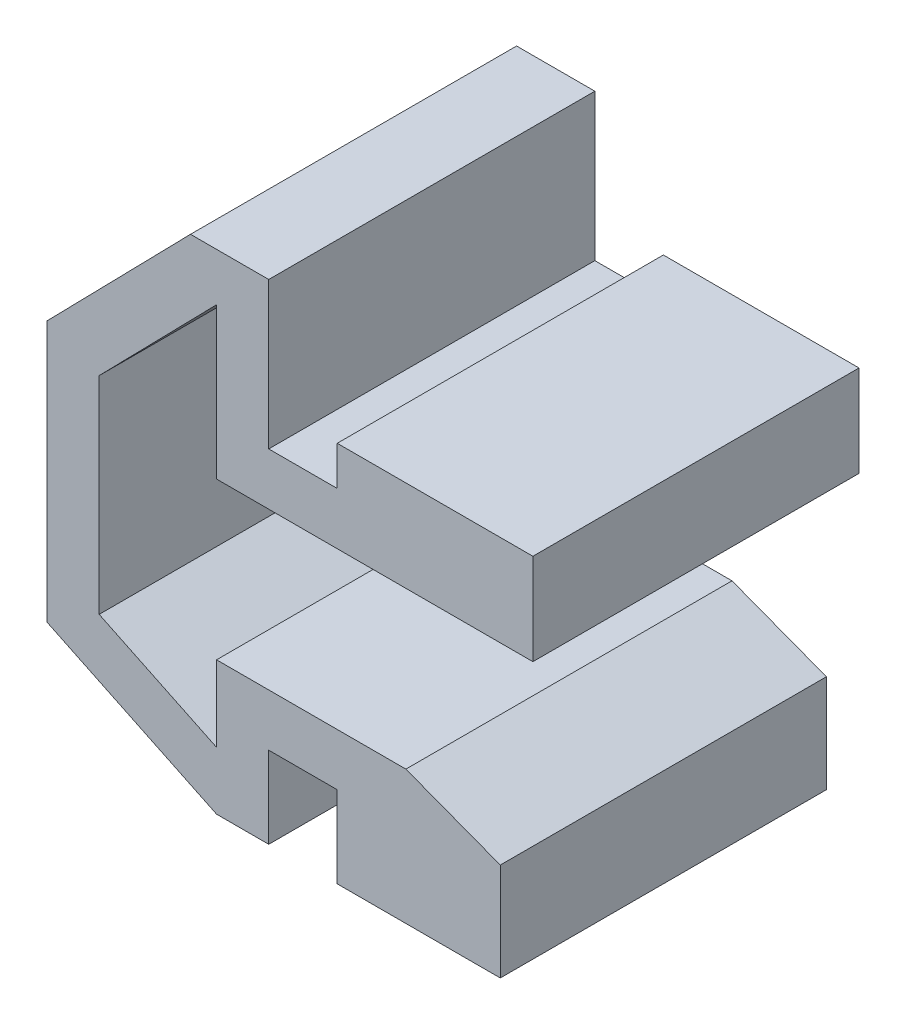
ISO-10303-21;
HEADER;
FILE_DESCRIPTION(('STEP AP214'),'2;1');
FILE_NAME('part.step','',(''),(''),'','','');
FILE_SCHEMA(('AUTOMOTIVE_DESIGN { 1 0 10303 214 1 1 1 1 }'));
ENDSEC;
DATA;
#1=APPLICATION_CONTEXT('core data for automotive mechanical design processes');
#2=APPLICATION_PROTOCOL_DEFINITION('international standard','automotive_design',2000,#1);
#3=PRODUCT_CONTEXT('',#1,'mechanical');
#4=PRODUCT('Part','Part','',(#3));
#5=PRODUCT_RELATED_PRODUCT_CATEGORY('part','',(#4));
#6=PRODUCT_DEFINITION_FORMATION('','',#4);
#7=PRODUCT_DEFINITION_CONTEXT('part definition',#1,'design');
#8=PRODUCT_DEFINITION('design','',#6,#7);
#9=PRODUCT_DEFINITION_SHAPE('','',#8);
#10=(LENGTH_UNIT() NAMED_UNIT(*) SI_UNIT(.MILLI.,.METRE.));
#11=(NAMED_UNIT(*) PLANE_ANGLE_UNIT() SI_UNIT($,.RADIAN.));
#12=(NAMED_UNIT(*) SI_UNIT($,.STERADIAN.) SOLID_ANGLE_UNIT());
#13=UNCERTAINTY_MEASURE_WITH_UNIT(LENGTH_MEASURE(1.E-05),#10,'distance_accuracy_value','');
#14=(GEOMETRIC_REPRESENTATION_CONTEXT(3) GLOBAL_UNCERTAINTY_ASSIGNED_CONTEXT((#13)) GLOBAL_UNIT_ASSIGNED_CONTEXT((#10,
#11,#12)) REPRESENTATION_CONTEXT('',''));
#15=CARTESIAN_POINT('',(0.,0.,0.));
#16=DIRECTION('',(0.,0.,1.));
#17=DIRECTION('',(1.,0.,0.));
#18=AXIS2_PLACEMENT_3D('',#15,#16,#17);
#19=CARTESIAN_POINT('',(0.,4.,5.));
#20=DIRECTION('',(0.,-1.,0.));
#21=DIRECTION('',(1.,0.,0.));
#22=AXIS2_PLACEMENT_3D('',#19,#20,#21);
#23=PLANE('',#22);
#24=DIRECTION('',(-1.,0.,0.));
#25=VECTOR('',#24,1.);
#26=CARTESIAN_POINT('',(0.,4.,-5.));
#27=LINE('',#26,#25);
#28=CARTESIAN_POINT('',(0.,4.,-5.));
#29=VERTEX_POINT('',#28);
#30=CARTESIAN_POINT('',(-2.1,4.,-5.));
#31=VERTEX_POINT('',#30);
#32=EDGE_CURVE('E139',#29,#31,#27,.T.);
#33=ORIENTED_EDGE('',*,*,#32,.T.);
#34=DIRECTION('',(0.,0.,-1.));
#35=VECTOR('',#34,1.);
#36=CARTESIAN_POINT('',(-2.1,4.,5.));
#37=LINE('',#36,#35);
#38=CARTESIAN_POINT('',(-2.1,4.,5.));
#39=VERTEX_POINT('',#38);
#40=EDGE_CURVE('E162',#39,#31,#37,.T.);
#41=ORIENTED_EDGE('',*,*,#40,.F.);
#42=DIRECTION('',(-1.,0.,0.));
#43=VECTOR('',#42,1.);
#44=CARTESIAN_POINT('',(0.,4.,5.));
#45=LINE('',#44,#43);
#46=CARTESIAN_POINT('',(0.,4.,5.));
#47=VERTEX_POINT('',#46);
#48=EDGE_CURVE('E93',#47,#39,#45,.T.);
#49=ORIENTED_EDGE('',*,*,#48,.F.);
#50=DIRECTION('',(0.,0.,-1.));
#51=VECTOR('',#50,1.);
#52=CARTESIAN_POINT('',(0.,4.,5.));
#53=LINE('',#52,#51);
#54=EDGE_CURVE('E40',#47,#29,#53,.T.);
#55=ORIENTED_EDGE('',*,*,#54,.T.);
#56=EDGE_LOOP('',(#33,#41,#49,#55));
#57=FACE_BOUND('',#56,.T.);
#58=ADVANCED_FACE('F33',(#57),#23,.F.);
#59=CARTESIAN_POINT('',(-2.1,4.,5.));
#60=DIRECTION('',(-1.,0.,0.));
#61=DIRECTION('',(0.,-1.,0.));
#62=AXIS2_PLACEMENT_3D('',#59,#60,#61);
#63=PLANE('',#62);
#64=DIRECTION('',(0.,1.,0.));
#65=VECTOR('',#64,1.);
#66=CARTESIAN_POINT('',(-2.1,4.,-5.));
#67=LINE('',#66,#65);
#68=CARTESIAN_POINT('',(-2.1,8.5,-5.));
#69=VERTEX_POINT('',#68);
#70=EDGE_CURVE('E141',#31,#69,#67,.T.);
#71=ORIENTED_EDGE('',*,*,#70,.T.);
#72=DIRECTION('',(0.,0.,-1.));
#73=VECTOR('',#72,1.);
#74=CARTESIAN_POINT('',(-2.1,8.5,5.));
#75=LINE('',#74,#73);
#76=CARTESIAN_POINT('',(-2.1,8.5,5.));
#77=VERTEX_POINT('',#76);
#78=EDGE_CURVE('E124',#77,#69,#75,.T.);
#79=ORIENTED_EDGE('',*,*,#78,.F.);
#80=DIRECTION('',(0.,1.,0.));
#81=VECTOR('',#80,1.);
#82=CARTESIAN_POINT('',(-2.1,4.,5.));
#83=LINE('',#82,#81);
#84=EDGE_CURVE('E112',#39,#77,#83,.T.);
#85=ORIENTED_EDGE('',*,*,#84,.F.);
#86=ORIENTED_EDGE('',*,*,#40,.T.);
#87=EDGE_LOOP('',(#71,#79,#85,#86));
#88=FACE_BOUND('',#87,.T.);
#89=ADVANCED_FACE('F239',(#88),#63,.F.);
#90=CARTESIAN_POINT('',(-2.1,8.5,5.));
#91=DIRECTION('',(4.26452854510965E-13,-1.,0.));
#92=DIRECTION('',(1.,4.26452854510965E-13,0.));
#93=AXIS2_PLACEMENT_3D('',#90,#91,#92);
#94=PLANE('',#93);
#95=DIRECTION('',(-1.,-4.26452854510965E-13,0.));
#96=VECTOR('',#95,1.);
#97=CARTESIAN_POINT('',(-2.1,8.5,-5.));
#98=LINE('',#97,#96);
#99=CARTESIAN_POINT('',(-4.5,8.49999999999898,-5.));
#100=VERTEX_POINT('',#99);
#101=EDGE_CURVE('E121',#69,#100,#98,.T.);
#102=ORIENTED_EDGE('',*,*,#101,.T.);
#103=DIRECTION('',(0.,0.,-1.));
#104=VECTOR('',#103,1.);
#105=CARTESIAN_POINT('',(-4.5,8.49999999999898,5.));
#106=LINE('',#105,#104);
#107=CARTESIAN_POINT('',(-4.5,8.49999999999898,5.));
#108=VERTEX_POINT('',#107);
#109=EDGE_CURVE('E118',#108,#100,#106,.T.);
#110=ORIENTED_EDGE('',*,*,#109,.F.);
#111=DIRECTION('',(-1.,-4.26452854510965E-13,0.));
#112=VECTOR('',#111,1.);
#113=CARTESIAN_POINT('',(-2.1,8.5,5.));
#114=LINE('',#113,#112);
#115=EDGE_CURVE('E103',#77,#108,#114,.T.);
#116=ORIENTED_EDGE('',*,*,#115,.F.);
#117=ORIENTED_EDGE('',*,*,#78,.T.);
#118=EDGE_LOOP('',(#102,#110,#116,#117));
#119=FACE_BOUND('',#118,.T.);
#120=ADVANCED_FACE('F119',(#119),#94,.F.);
#121=CARTESIAN_POINT('',(-4.5,8.49999999999898,5.));
#122=DIRECTION('',(0.715006669012978,-0.69911763192396,0.));
#123=DIRECTION('',(0.69911763192396,0.715006669012978,0.));
#124=AXIS2_PLACEMENT_3D('',#121,#122,#123);
#125=PLANE('',#124);
#126=DIRECTION('',(-0.69911763192396,-0.715006669012978,0.));
#127=VECTOR('',#126,1.);
#128=CARTESIAN_POINT('',(-4.5,8.49999999999898,-5.));
#129=LINE('',#128,#127);
#130=CARTESIAN_POINT('',(-8.9,4.,-5.));
#131=VERTEX_POINT('',#130);
#132=EDGE_CURVE('E145',#100,#131,#129,.T.);
#133=ORIENTED_EDGE('',*,*,#132,.T.);
#134=DIRECTION('',(0.,0.,-1.));
#135=VECTOR('',#134,1.);
#136=CARTESIAN_POINT('',(-8.9,4.,5.));
#137=LINE('',#136,#135);
#138=CARTESIAN_POINT('',(-8.9,4.,5.));
#139=VERTEX_POINT('',#138);
#140=EDGE_CURVE('E125',#139,#131,#137,.T.);
#141=ORIENTED_EDGE('',*,*,#140,.F.);
#142=DIRECTION('',(-0.69911763192396,-0.715006669012978,0.));
#143=VECTOR('',#142,1.);
#144=CARTESIAN_POINT('',(-4.5,8.49999999999898,5.));
#145=LINE('',#144,#143);
#146=EDGE_CURVE('E109',#108,#139,#145,.T.);
#147=ORIENTED_EDGE('',*,*,#146,.F.);
#148=ORIENTED_EDGE('',*,*,#109,.T.);
#149=EDGE_LOOP('',(#133,#141,#147,#148));
#150=FACE_BOUND('',#149,.T.);
#151=ADVANCED_FACE('F127',(#150),#125,.F.);
#152=CARTESIAN_POINT('',(-8.9,4.,5.));
#153=DIRECTION('',(1.,0.,0.));
#154=DIRECTION('',(0.,0.,-1.));
#155=AXIS2_PLACEMENT_3D('',#152,#153,#154);
#156=PLANE('',#155);
#157=DIRECTION('',(0.,-1.,0.));
#158=VECTOR('',#157,1.);
#159=CARTESIAN_POINT('',(-8.9,4.,-5.));
#160=LINE('',#159,#158);
#161=CARTESIAN_POINT('',(-8.9,-4.,-5.));
#162=VERTEX_POINT('',#161);
#163=EDGE_CURVE('E147',#131,#162,#160,.T.);
#164=ORIENTED_EDGE('',*,*,#163,.T.);
#165=DIRECTION('',(0.,0.,-1.));
#166=VECTOR('',#165,1.);
#167=CARTESIAN_POINT('',(-8.9,-4.,5.));
#168=LINE('',#167,#166);
#169=CARTESIAN_POINT('',(-8.9,-4.,5.));
#170=VERTEX_POINT('',#169);
#171=EDGE_CURVE('E158',#170,#162,#168,.T.);
#172=ORIENTED_EDGE('',*,*,#171,.F.);
#173=DIRECTION('',(0.,-1.,0.));
#174=VECTOR('',#173,1.);
#175=CARTESIAN_POINT('',(-8.9,4.,5.));
#176=LINE('',#175,#174);
#177=EDGE_CURVE('E130',#139,#170,#176,.T.);
#178=ORIENTED_EDGE('',*,*,#177,.F.);
#179=ORIENTED_EDGE('',*,*,#140,.T.);
#180=EDGE_LOOP('',(#164,#172,#178,#179));
#181=FACE_BOUND('',#180,.T.);
#182=ADVANCED_FACE('F243',(#181),#156,.F.);
#183=CARTESIAN_POINT('',(-2.1,-4.,5.));
#184=DIRECTION('',(-1.,0.,0.));
#185=DIRECTION('',(0.,-1.,0.));
#186=AXIS2_PLACEMENT_3D('',#183,#184,#185);
#187=PLANE('',#186);
#188=DIRECTION('',(0.,1.,0.));
#189=VECTOR('',#188,1.);
#190=CARTESIAN_POINT('',(-2.1,-4.,5.));
#191=LINE('',#190,#189);
#192=CARTESIAN_POINT('',(-2.1,-6.5,5.));
#193=VERTEX_POINT('',#192);
#194=CARTESIAN_POINT('',(-2.1,-4.,5.));
#195=VERTEX_POINT('',#194);
#196=EDGE_CURVE('E56',#193,#195,#191,.T.);
#197=ORIENTED_EDGE('',*,*,#196,.F.);
#198=DIRECTION('',(0.,0.,-1.));
#199=VECTOR('',#198,1.);
#200=CARTESIAN_POINT('',(-2.1,-6.5,5.));
#201=LINE('',#200,#199);
#202=CARTESIAN_POINT('',(-2.1,-6.5,-5.));
#203=VERTEX_POINT('',#202);
#204=EDGE_CURVE('E559',#193,#203,#201,.T.);
#205=ORIENTED_EDGE('',*,*,#204,.T.);
#206=DIRECTION('',(0.,1.,0.));
#207=VECTOR('',#206,1.);
#208=CARTESIAN_POINT('',(-2.1,-4.,-5.));
#209=LINE('',#208,#207);
#210=CARTESIAN_POINT('',(-2.1,-4.,-5.));
#211=VERTEX_POINT('',#210);
#212=EDGE_CURVE('E84',#203,#211,#209,.T.);
#213=ORIENTED_EDGE('',*,*,#212,.T.);
#214=DIRECTION('',(0.,0.,-1.));
#215=VECTOR('',#214,1.);
#216=CARTESIAN_POINT('',(-2.1,-4.,5.));
#217=LINE('',#216,#215);
#218=EDGE_CURVE('E156',#195,#211,#217,.T.);
#219=ORIENTED_EDGE('',*,*,#218,.F.);
#220=EDGE_LOOP('',(#197,#205,#213,#219));
#221=FACE_BOUND('',#220,.T.);
#222=ADVANCED_FACE('F435',(#221),#187,.F.);
#223=CARTESIAN_POINT('',(0.,-4.,5.));
#224=DIRECTION('',(0.,1.,0.));
#225=DIRECTION('',(-1.,0.,0.));
#226=AXIS2_PLACEMENT_3D('',#223,#224,#225);
#227=PLANE('',#226);
#228=DIRECTION('',(1.,0.,0.));
#229=VECTOR('',#228,1.);
#230=CARTESIAN_POINT('',(0.,-4.,-5.));
#231=LINE('',#230,#229);
#232=CARTESIAN_POINT('',(0.,-4.,-5.));
#233=VERTEX_POINT('',#232);
#234=EDGE_CURVE('E151',#211,#233,#231,.T.);
#235=ORIENTED_EDGE('',*,*,#234,.T.);
#236=DIRECTION('',(0.,0.,-1.));
#237=VECTOR('',#236,1.);
#238=CARTESIAN_POINT('',(0.,-4.,5.));
#239=LINE('',#238,#237);
#240=CARTESIAN_POINT('',(0.,-4.,5.));
#241=VERTEX_POINT('',#240);
#242=EDGE_CURVE('E138',#241,#233,#239,.T.);
#243=ORIENTED_EDGE('',*,*,#242,.F.);
#244=DIRECTION('',(1.,0.,0.));
#245=VECTOR('',#244,1.);
#246=CARTESIAN_POINT('',(0.,-4.,5.));
#247=LINE('',#246,#245);
#248=EDGE_CURVE('E136',#195,#241,#247,.T.);
#249=ORIENTED_EDGE('',*,*,#248,.F.);
#250=ORIENTED_EDGE('',*,*,#218,.T.);
#251=EDGE_LOOP('',(#235,#243,#249,#250));
#252=FACE_BOUND('',#251,.T.);
#253=ADVANCED_FACE('F333',(#252),#227,.F.);
#254=CARTESIAN_POINT('',(0.,0.,5.));
#255=DIRECTION('',(0.,0.,-1.));
#256=DIRECTION('',(-1.,0.,0.));
#257=AXIS2_PLACEMENT_3D('',#254,#255,#256);
#258=PLANE('',#257);
#259=DIRECTION('',(0.901252424525186,-0.433294434867878,0.));
#260=VECTOR('',#259,1.);
#261=CARTESIAN_POINT('',(-3.7,-6.5,5.));
#262=LINE('',#261,#260);
#263=CARTESIAN_POINT('',(-3.7,-6.5,5.));
#264=VERTEX_POINT('',#263);
#265=EDGE_CURVE('E248',#170,#264,#262,.T.);
#266=ORIENTED_EDGE('',*,*,#265,.T.);
#267=DIRECTION('',(1.,0.,0.));
#268=VECTOR('',#267,1.);
#269=CARTESIAN_POINT('',(-3.7,-6.5,5.));
#270=LINE('',#269,#268);
#271=EDGE_CURVE('E551',#264,#193,#270,.T.);
#272=ORIENTED_EDGE('',*,*,#271,.T.);
#273=ORIENTED_EDGE('',*,*,#196,.T.);
#274=ORIENTED_EDGE('',*,*,#248,.T.);
#275=DIRECTION('',(0.,1.,0.));
#276=VECTOR('',#275,1.);
#277=CARTESIAN_POINT('',(0.,-1.6,5.));
#278=LINE('',#277,#276);
#279=CARTESIAN_POINT('',(0.,-6.5,5.));
#280=VERTEX_POINT('',#279);
#281=EDGE_CURVE('E206',#280,#241,#278,.T.);
#282=ORIENTED_EDGE('',*,*,#281,.F.);
#283=DIRECTION('',(-1.,0.,0.));
#284=VECTOR('',#283,1.);
#285=CARTESIAN_POINT('',(0.,-6.5,5.));
#286=LINE('',#285,#284);
#287=CARTESIAN_POINT('',(5.,-6.5,5.));
#288=VERTEX_POINT('',#287);
#289=EDGE_CURVE('E216',#288,#280,#286,.T.);
#290=ORIENTED_EDGE('',*,*,#289,.F.);
#291=DIRECTION('',(0.,-1.,0.));
#292=VECTOR('',#291,1.);
#293=CARTESIAN_POINT('',(5.,-6.5,5.));
#294=LINE('',#293,#292);
#295=CARTESIAN_POINT('',(5.,-3.5,5.));
#296=VERTEX_POINT('',#295);
#297=EDGE_CURVE('E213',#296,#288,#294,.T.);
#298=ORIENTED_EDGE('',*,*,#297,.F.);
#299=DIRECTION('',(0.934783580588349,-0.355217760623573,0.));
#300=VECTOR('',#299,1.);
#301=CARTESIAN_POINT('',(5.,-3.5,5.));
#302=LINE('',#301,#300);
#303=CARTESIAN_POINT('',(2.10526315789472,-2.4,5.));
#304=VERTEX_POINT('',#303);
#305=EDGE_CURVE('E209',#304,#296,#302,.T.);
#306=ORIENTED_EDGE('',*,*,#305,.F.);
#307=DIRECTION('',(-1.,0.,0.));
#308=VECTOR('',#307,1.);
#309=CARTESIAN_POINT('',(-3.7,-2.4,5.));
#310=LINE('',#309,#308);
#311=CARTESIAN_POINT('',(-3.7,-2.4,5.));
#312=VERTEX_POINT('',#311);
#313=EDGE_CURVE('E350',#304,#312,#310,.T.);
#314=ORIENTED_EDGE('',*,*,#313,.T.);
#315=DIRECTION('',(0.,-1.,0.));
#316=VECTOR('',#315,1.);
#317=CARTESIAN_POINT('',(-3.7,-4.72469270932287,5.));
#318=LINE('',#317,#316);
#319=CARTESIAN_POINT('',(-3.7,-4.72469270932287,5.));
#320=VERTEX_POINT('',#319);
#321=EDGE_CURVE('E353',#312,#320,#318,.T.);
#322=ORIENTED_EDGE('',*,*,#321,.T.);
#323=DIRECTION('',(-0.901252424525186,0.433294434867878,0.));
#324=VECTOR('',#323,1.);
#325=CARTESIAN_POINT('',(-7.3,-2.99392347855364,5.));
#326=LINE('',#325,#324);
#327=CARTESIAN_POINT('',(-7.3,-2.99392347855364,5.));
#328=VERTEX_POINT('',#327);
#329=EDGE_CURVE('E562',#320,#328,#326,.T.);
#330=ORIENTED_EDGE('',*,*,#329,.T.);
#331=DIRECTION('',(0.,1.,0.));
#332=VECTOR('',#331,1.);
#333=CARTESIAN_POINT('',(-7.3,3.34776451235487,5.));
#334=LINE('',#333,#332);
#335=CARTESIAN_POINT('',(-7.3,3.34776451235487,5.));
#336=VERTEX_POINT('',#335);
#337=EDGE_CURVE('E564',#328,#336,#334,.T.);
#338=ORIENTED_EDGE('',*,*,#337,.T.);
#339=DIRECTION('',(0.69911763192396,0.715006669012978,0.));
#340=VECTOR('',#339,1.);
#341=CARTESIAN_POINT('',(-3.7,7.02958269417221,5.));
#342=LINE('',#341,#340);
#343=CARTESIAN_POINT('',(-3.7,7.02958269417221,5.));
#344=VERTEX_POINT('',#343);
#345=EDGE_CURVE('E567',#336,#344,#342,.T.);
#346=ORIENTED_EDGE('',*,*,#345,.T.);
#347=DIRECTION('',(0.,-1.,0.));
#348=VECTOR('',#347,1.);
#349=CARTESIAN_POINT('',(-3.7,2.4,5.));
#350=LINE('',#349,#348);
#351=CARTESIAN_POINT('',(-3.7,2.4,5.));
#352=VERTEX_POINT('',#351);
#353=EDGE_CURVE('E361',#344,#352,#350,.T.);
#354=ORIENTED_EDGE('',*,*,#353,.T.);
#355=DIRECTION('',(1.,0.,0.));
#356=VECTOR('',#355,1.);
#357=CARTESIAN_POINT('',(-3.7,2.4,5.));
#358=LINE('',#357,#356);
#359=CARTESIAN_POINT('',(6.,2.4,5.));
#360=VERTEX_POINT('',#359);
#361=EDGE_CURVE('E356',#352,#360,#358,.T.);
#362=ORIENTED_EDGE('',*,*,#361,.T.);
#363=DIRECTION('',(0.,-1.,0.));
#364=VECTOR('',#363,1.);
#365=CARTESIAN_POINT('',(6.,5.2,5.));
#366=LINE('',#365,#364);
#367=CARTESIAN_POINT('',(6.,5.2,5.));
#368=VERTEX_POINT('',#367);
#369=EDGE_CURVE('E195',#368,#360,#366,.T.);
#370=ORIENTED_EDGE('',*,*,#369,.F.);
#371=DIRECTION('',(1.,0.,0.));
#372=VECTOR('',#371,1.);
#373=CARTESIAN_POINT('',(0.,5.2,5.));
#374=LINE('',#373,#372);
#375=CARTESIAN_POINT('',(0.,5.2,5.));
#376=VERTEX_POINT('',#375);
#377=EDGE_CURVE('E392',#376,#368,#374,.T.);
#378=ORIENTED_EDGE('',*,*,#377,.F.);
#379=DIRECTION('',(0.,1.,0.));
#380=VECTOR('',#379,1.);
#381=CARTESIAN_POINT('',(0.,1.,5.));
#382=LINE('',#381,#380);
#383=EDGE_CURVE('E200',#47,#376,#382,.T.);
#384=ORIENTED_EDGE('',*,*,#383,.F.);
#385=ORIENTED_EDGE('',*,*,#48,.T.);
#386=ORIENTED_EDGE('',*,*,#84,.T.);
#387=ORIENTED_EDGE('',*,*,#115,.T.);
#388=ORIENTED_EDGE('',*,*,#146,.T.);
#389=ORIENTED_EDGE('',*,*,#177,.T.);
#390=EDGE_LOOP('',(#266,#272,#273,#274,#282,#290,#298,#306,#314,#322,#330,#338,#346,#354,#362,
#370,#378,#384,#385,#386,#387,#388,#389));
#391=FACE_BOUND('',#390,.T.);
#392=ADVANCED_FACE('F106',(#391),#258,.F.);
#393=CARTESIAN_POINT('',(0.,0.,-5.));
#394=DIRECTION('',(0.,0.,-1.));
#395=DIRECTION('',(-1.,0.,0.));
#396=AXIS2_PLACEMENT_3D('',#393,#394,#395);
#397=PLANE('',#396);
#398=DIRECTION('',(1.,0.,0.));
#399=VECTOR('',#398,1.);
#400=CARTESIAN_POINT('',(-3.7,-6.5,-5.));
#401=LINE('',#400,#399);
#402=CARTESIAN_POINT('',(-3.7,-6.5,-5.));
#403=VERTEX_POINT('',#402);
#404=EDGE_CURVE('E552',#403,#203,#401,.T.);
#405=ORIENTED_EDGE('',*,*,#404,.F.);
#406=DIRECTION('',(0.901252424525186,-0.433294434867878,0.));
#407=VECTOR('',#406,1.);
#408=CARTESIAN_POINT('',(-3.7,-6.5,-5.));
#409=LINE('',#408,#407);
#410=EDGE_CURVE('E549',#162,#403,#409,.T.);
#411=ORIENTED_EDGE('',*,*,#410,.F.);
#412=ORIENTED_EDGE('',*,*,#163,.F.);
#413=ORIENTED_EDGE('',*,*,#132,.F.);
#414=ORIENTED_EDGE('',*,*,#101,.F.);
#415=ORIENTED_EDGE('',*,*,#70,.F.);
#416=ORIENTED_EDGE('',*,*,#32,.F.);
#417=DIRECTION('',(0.,1.,0.));
#418=VECTOR('',#417,1.);
#419=CARTESIAN_POINT('',(0.,4.,-5.));
#420=LINE('',#419,#418);
#421=CARTESIAN_POINT('',(0.,5.2,-5.));
#422=VERTEX_POINT('',#421);
#423=EDGE_CURVE('E180',#29,#422,#420,.T.);
#424=ORIENTED_EDGE('',*,*,#423,.T.);
#425=DIRECTION('',(1.,0.,0.));
#426=VECTOR('',#425,1.);
#427=CARTESIAN_POINT('',(0.,5.2,-5.));
#428=LINE('',#427,#426);
#429=CARTESIAN_POINT('',(6.,5.2,-5.));
#430=VERTEX_POINT('',#429);
#431=EDGE_CURVE('E186',#422,#430,#428,.T.);
#432=ORIENTED_EDGE('',*,*,#431,.T.);
#433=DIRECTION('',(0.,-1.,0.));
#434=VECTOR('',#433,1.);
#435=CARTESIAN_POINT('',(6.,5.2,-5.));
#436=LINE('',#435,#434);
#437=CARTESIAN_POINT('',(6.,2.4,-5.));
#438=VERTEX_POINT('',#437);
#439=EDGE_CURVE('E189',#430,#438,#436,.T.);
#440=ORIENTED_EDGE('',*,*,#439,.T.);
#441=DIRECTION('',(1.,0.,0.));
#442=VECTOR('',#441,1.);
#443=CARTESIAN_POINT('',(-3.7,2.4,-5.));
#444=LINE('',#443,#442);
#445=CARTESIAN_POINT('',(-3.7,2.4,-5.));
#446=VERTEX_POINT('',#445);
#447=EDGE_CURVE('E47',#446,#438,#444,.T.);
#448=ORIENTED_EDGE('',*,*,#447,.F.);
#449=DIRECTION('',(0.,-1.,0.));
#450=VECTOR('',#449,1.);
#451=CARTESIAN_POINT('',(-3.7,2.4,-5.));
#452=LINE('',#451,#450);
#453=CARTESIAN_POINT('',(-3.7,7.02958269417221,-5.));
#454=VERTEX_POINT('',#453);
#455=EDGE_CURVE('E378',#454,#446,#452,.T.);
#456=ORIENTED_EDGE('',*,*,#455,.F.);
#457=DIRECTION('',(0.69911763192396,0.715006669012978,0.));
#458=VECTOR('',#457,1.);
#459=CARTESIAN_POINT('',(-3.7,7.02958269417221,-5.));
#460=LINE('',#459,#458);
#461=CARTESIAN_POINT('',(-7.3,3.34776451235487,-5.));
#462=VERTEX_POINT('',#461);
#463=EDGE_CURVE('E375',#462,#454,#460,.T.);
#464=ORIENTED_EDGE('',*,*,#463,.F.);
#465=DIRECTION('',(0.,1.,0.));
#466=VECTOR('',#465,1.);
#467=CARTESIAN_POINT('',(-7.3,3.34776451235487,-5.));
#468=LINE('',#467,#466);
#469=CARTESIAN_POINT('',(-7.3,-2.99392347855364,-5.));
#470=VERTEX_POINT('',#469);
#471=EDGE_CURVE('E372',#470,#462,#468,.T.);
#472=ORIENTED_EDGE('',*,*,#471,.F.);
#473=DIRECTION('',(-0.901252424525186,0.433294434867878,0.));
#474=VECTOR('',#473,1.);
#475=CARTESIAN_POINT('',(-7.3,-2.99392347855364,-5.));
#476=LINE('',#475,#474);
#477=CARTESIAN_POINT('',(-3.7,-4.72469270932287,-5.));
#478=VERTEX_POINT('',#477);
#479=EDGE_CURVE('E368',#478,#470,#476,.T.);
#480=ORIENTED_EDGE('',*,*,#479,.F.);
#481=DIRECTION('',(0.,-1.,0.));
#482=VECTOR('',#481,1.);
#483=CARTESIAN_POINT('',(-3.7,-4.72469270932287,-5.));
#484=LINE('',#483,#482);
#485=CARTESIAN_POINT('',(-3.7,-2.4,-5.));
#486=VERTEX_POINT('',#485);
#487=EDGE_CURVE('E365',#486,#478,#484,.T.);
#488=ORIENTED_EDGE('',*,*,#487,.F.);
#489=DIRECTION('',(-1.,0.,0.));
#490=VECTOR('',#489,1.);
#491=CARTESIAN_POINT('',(-3.7,-2.4,-5.));
#492=LINE('',#491,#490);
#493=CARTESIAN_POINT('',(2.10526315789472,-2.4,-5.));
#494=VERTEX_POINT('',#493);
#495=EDGE_CURVE('E382',#494,#486,#492,.T.);
#496=ORIENTED_EDGE('',*,*,#495,.F.);
#497=DIRECTION('',(0.934783580588349,-0.355217760623573,0.));
#498=VECTOR('',#497,1.);
#499=CARTESIAN_POINT('',(5.,-3.5,-5.));
#500=LINE('',#499,#498);
#501=CARTESIAN_POINT('',(5.,-3.5,-5.));
#502=VERTEX_POINT('',#501);
#503=EDGE_CURVE('E204',#494,#502,#500,.T.);
#504=ORIENTED_EDGE('',*,*,#503,.T.);
#505=DIRECTION('',(0.,-1.,0.));
#506=VECTOR('',#505,1.);
#507=CARTESIAN_POINT('',(5.,-6.5,-5.));
#508=LINE('',#507,#506);
#509=CARTESIAN_POINT('',(5.,-6.5,-5.));
#510=VERTEX_POINT('',#509);
#511=EDGE_CURVE('E222',#502,#510,#508,.T.);
#512=ORIENTED_EDGE('',*,*,#511,.T.);
#513=DIRECTION('',(-1.,0.,0.));
#514=VECTOR('',#513,1.);
#515=CARTESIAN_POINT('',(0.,-6.5,-5.));
#516=LINE('',#515,#514);
#517=CARTESIAN_POINT('',(0.,-6.5,-5.));
#518=VERTEX_POINT('',#517);
#519=EDGE_CURVE('E225',#510,#518,#516,.T.);
#520=ORIENTED_EDGE('',*,*,#519,.T.);
#521=DIRECTION('',(0.,1.,0.));
#522=VECTOR('',#521,1.);
#523=CARTESIAN_POINT('',(0.,-4.,-5.));
#524=LINE('',#523,#522);
#525=EDGE_CURVE('E210',#518,#233,#524,.T.);
#526=ORIENTED_EDGE('',*,*,#525,.T.);
#527=ORIENTED_EDGE('',*,*,#234,.F.);
#528=ORIENTED_EDGE('',*,*,#212,.F.);
#529=EDGE_LOOP('',(#405,#411,#412,#413,#414,#415,#416,#424,#432,#440,#448,#456,#464,#472,#480,
#488,#496,#504,#512,#520,#526,#527,#528));
#530=FACE_BOUND('',#529,.T.);
#531=ADVANCED_FACE('F177',(#530),#397,.T.);
#532=CARTESIAN_POINT('',(0.,-4.,5.));
#533=DIRECTION('',(-1.,0.,0.));
#534=DIRECTION('',(0.,-1.,0.));
#535=AXIS2_PLACEMENT_3D('',#532,#533,#534);
#536=PLANE('',#535);
#537=ORIENTED_EDGE('',*,*,#281,.T.);
#538=ORIENTED_EDGE('',*,*,#242,.T.);
#539=ORIENTED_EDGE('',*,*,#525,.F.);
#540=DIRECTION('',(0.,0.,-1.));
#541=VECTOR('',#540,1.);
#542=CARTESIAN_POINT('',(0.,-6.5,5.));
#543=LINE('',#542,#541);
#544=EDGE_CURVE('E142',#280,#518,#543,.T.);
#545=ORIENTED_EDGE('',*,*,#544,.F.);
#546=EDGE_LOOP('',(#537,#538,#539,#545));
#547=FACE_BOUND('',#546,.T.);
#548=ADVANCED_FACE('F329',(#547),#536,.T.);
#549=CARTESIAN_POINT('',(0.,-6.5,5.));
#550=DIRECTION('',(0.,-1.,0.));
#551=DIRECTION('',(0.,0.,-1.));
#552=AXIS2_PLACEMENT_3D('',#549,#550,#551);
#553=PLANE('',#552);
#554=ORIENTED_EDGE('',*,*,#519,.F.);
#555=DIRECTION('',(0.,0.,-1.));
#556=VECTOR('',#555,1.);
#557=CARTESIAN_POINT('',(5.,-6.5,5.));
#558=LINE('',#557,#556);
#559=EDGE_CURVE('E232',#288,#510,#558,.T.);
#560=ORIENTED_EDGE('',*,*,#559,.F.);
#561=ORIENTED_EDGE('',*,*,#289,.T.);
#562=ORIENTED_EDGE('',*,*,#544,.T.);
#563=EDGE_LOOP('',(#554,#560,#561,#562));
#564=FACE_BOUND('',#563,.T.);
#565=ADVANCED_FACE('F338',(#564),#553,.T.);
#566=CARTESIAN_POINT('',(5.,-6.5,5.));
#567=DIRECTION('',(1.,0.,0.));
#568=DIRECTION('',(0.,0.,-1.));
#569=AXIS2_PLACEMENT_3D('',#566,#567,#568);
#570=PLANE('',#569);
#571=ORIENTED_EDGE('',*,*,#511,.F.);
#572=DIRECTION('',(0.,0.,-1.));
#573=VECTOR('',#572,1.);
#574=CARTESIAN_POINT('',(5.,-3.5,5.));
#575=LINE('',#574,#573);
#576=EDGE_CURVE('E219',#296,#502,#575,.T.);
#577=ORIENTED_EDGE('',*,*,#576,.F.);
#578=ORIENTED_EDGE('',*,*,#297,.T.);
#579=ORIENTED_EDGE('',*,*,#559,.T.);
#580=EDGE_LOOP('',(#571,#577,#578,#579));
#581=FACE_BOUND('',#580,.T.);
#582=ADVANCED_FACE('F343',(#581),#570,.T.);
#583=CARTESIAN_POINT('',(5.,-3.5,5.));
#584=DIRECTION('',(0.355217760623573,0.934783580588349,0.));
#585=DIRECTION('',(-0.934783580588349,0.355217760623573,0.));
#586=AXIS2_PLACEMENT_3D('',#583,#584,#585);
#587=PLANE('',#586);
#588=DIRECTION('',(0.,0.,-1.));
#589=VECTOR('',#588,1.);
#590=CARTESIAN_POINT('',(2.10526315789473,-2.4,5.));
#591=LINE('',#590,#589);
#592=EDGE_CURVE('E11',#304,#494,#591,.T.);
#593=ORIENTED_EDGE('',*,*,#592,.F.);
#594=ORIENTED_EDGE('',*,*,#305,.T.);
#595=ORIENTED_EDGE('',*,*,#576,.T.);
#596=ORIENTED_EDGE('',*,*,#503,.F.);
#597=EDGE_LOOP('',(#593,#594,#595,#596));
#598=FACE_BOUND('',#597,.T.);
#599=ADVANCED_FACE('F347',(#598),#587,.T.);
#600=CARTESIAN_POINT('',(0.,4.,5.));
#601=DIRECTION('',(-1.,0.,0.));
#602=DIRECTION('',(0.,0.,1.));
#603=AXIS2_PLACEMENT_3D('',#600,#601,#602);
#604=PLANE('',#603);
#605=ORIENTED_EDGE('',*,*,#54,.F.);
#606=ORIENTED_EDGE('',*,*,#383,.T.);
#607=DIRECTION('',(0.,0.,-1.));
#608=VECTOR('',#607,1.);
#609=CARTESIAN_POINT('',(0.,5.2,5.));
#610=LINE('',#609,#608);
#611=EDGE_CURVE('E184',#376,#422,#610,.T.);
#612=ORIENTED_EDGE('',*,*,#611,.T.);
#613=ORIENTED_EDGE('',*,*,#423,.F.);
#614=EDGE_LOOP('',(#605,#606,#612,#613));
#615=FACE_BOUND('',#614,.T.);
#616=ADVANCED_FACE('F182',(#615),#604,.T.);
#617=CARTESIAN_POINT('',(6.,5.2,5.));
#618=DIRECTION('',(1.,0.,0.));
#619=DIRECTION('',(0.,0.,-1.));
#620=AXIS2_PLACEMENT_3D('',#617,#618,#619);
#621=PLANE('',#620);
#622=DIRECTION('',(0.,0.,-1.));
#623=VECTOR('',#622,1.);
#624=CARTESIAN_POINT('',(6.,2.4,5.));
#625=LINE('',#624,#623);
#626=EDGE_CURVE('E192',#360,#438,#625,.T.);
#627=ORIENTED_EDGE('',*,*,#626,.T.);
#628=ORIENTED_EDGE('',*,*,#439,.F.);
#629=DIRECTION('',(0.,0.,-1.));
#630=VECTOR('',#629,1.);
#631=CARTESIAN_POINT('',(6.,5.2,5.));
#632=LINE('',#631,#630);
#633=EDGE_CURVE('E201',#368,#430,#632,.T.);
#634=ORIENTED_EDGE('',*,*,#633,.F.);
#635=ORIENTED_EDGE('',*,*,#369,.T.);
#636=EDGE_LOOP('',(#627,#628,#634,#635));
#637=FACE_BOUND('',#636,.T.);
#638=ADVANCED_FACE('F398',(#637),#621,.T.);
#639=CARTESIAN_POINT('',(0.,5.2,5.));
#640=DIRECTION('',(0.,1.,0.));
#641=DIRECTION('',(0.,0.,1.));
#642=AXIS2_PLACEMENT_3D('',#639,#640,#641);
#643=PLANE('',#642);
#644=ORIENTED_EDGE('',*,*,#431,.F.);
#645=ORIENTED_EDGE('',*,*,#611,.F.);
#646=ORIENTED_EDGE('',*,*,#377,.T.);
#647=ORIENTED_EDGE('',*,*,#633,.T.);
#648=EDGE_LOOP('',(#644,#645,#646,#647));
#649=FACE_BOUND('',#648,.T.);
#650=ADVANCED_FACE('F409',(#649),#643,.T.);
#651=CARTESIAN_POINT('',(-3.7,-4.72469270932287,5.));
#652=DIRECTION('',(1.,0.,0.));
#653=DIRECTION('',(0.,0.,-1.));
#654=AXIS2_PLACEMENT_3D('',#651,#652,#653);
#655=PLANE('',#654);
#656=ORIENTED_EDGE('',*,*,#487,.T.);
#657=DIRECTION('',(0.,0.,-1.));
#658=VECTOR('',#657,1.);
#659=CARTESIAN_POINT('',(-3.7,-4.72469270932287,5.));
#660=LINE('',#659,#658);
#661=EDGE_CURVE('E355',#320,#478,#660,.T.);
#662=ORIENTED_EDGE('',*,*,#661,.F.);
#663=ORIENTED_EDGE('',*,*,#321,.F.);
#664=DIRECTION('',(0.,0.,-1.));
#665=VECTOR('',#664,1.);
#666=CARTESIAN_POINT('',(-3.7,-2.4,5.));
#667=LINE('',#666,#665);
#668=EDGE_CURVE('E187',#312,#486,#667,.T.);
#669=ORIENTED_EDGE('',*,*,#668,.T.);
#670=EDGE_LOOP('',(#656,#662,#663,#669));
#671=FACE_BOUND('',#670,.T.);
#672=ADVANCED_FACE('F411',(#671),#655,.F.);
#673=CARTESIAN_POINT('',(-3.7,-2.4,5.));
#674=DIRECTION('',(0.,-1.,0.));
#675=DIRECTION('',(0.,0.,-1.));
#676=AXIS2_PLACEMENT_3D('',#673,#674,#675);
#677=PLANE('',#676);
#678=ORIENTED_EDGE('',*,*,#592,.T.);
#679=ORIENTED_EDGE('',*,*,#495,.T.);
#680=ORIENTED_EDGE('',*,*,#668,.F.);
#681=ORIENTED_EDGE('',*,*,#313,.F.);
#682=EDGE_LOOP('',(#678,#679,#680,#681));
#683=FACE_BOUND('',#682,.T.);
#684=ADVANCED_FACE('F417',(#683),#677,.F.);
#685=CARTESIAN_POINT('',(-3.7,2.4,5.));
#686=DIRECTION('',(0.,1.,0.));
#687=DIRECTION('',(-1.,0.,0.));
#688=AXIS2_PLACEMENT_3D('',#685,#686,#687);
#689=PLANE('',#688);
#690=ORIENTED_EDGE('',*,*,#447,.T.);
#691=ORIENTED_EDGE('',*,*,#626,.F.);
#692=ORIENTED_EDGE('',*,*,#361,.F.);
#693=DIRECTION('',(0.,0.,-1.));
#694=VECTOR('',#693,1.);
#695=CARTESIAN_POINT('',(-3.7,2.4,5.));
#696=LINE('',#695,#694);
#697=EDGE_CURVE('E385',#352,#446,#696,.T.);
#698=ORIENTED_EDGE('',*,*,#697,.T.);
#699=EDGE_LOOP('',(#690,#691,#692,#698));
#700=FACE_BOUND('',#699,.T.);
#701=ADVANCED_FACE('F404',(#700),#689,.F.);
#702=CARTESIAN_POINT('',(-3.7,2.4,5.));
#703=DIRECTION('',(1.,0.,0.));
#704=DIRECTION('',(0.,1.,0.));
#705=AXIS2_PLACEMENT_3D('',#702,#703,#704);
#706=PLANE('',#705);
#707=ORIENTED_EDGE('',*,*,#455,.T.);
#708=ORIENTED_EDGE('',*,*,#697,.F.);
#709=ORIENTED_EDGE('',*,*,#353,.F.);
#710=DIRECTION('',(0.,0.,-1.));
#711=VECTOR('',#710,1.);
#712=CARTESIAN_POINT('',(-3.7,7.02958269417221,5.));
#713=LINE('',#712,#711);
#714=EDGE_CURVE('E387',#344,#454,#713,.T.);
#715=ORIENTED_EDGE('',*,*,#714,.T.);
#716=EDGE_LOOP('',(#707,#708,#709,#715));
#717=FACE_BOUND('',#716,.T.);
#718=ADVANCED_FACE('F407',(#717),#706,.F.);
#719=CARTESIAN_POINT('',(-3.7,7.02958269417221,5.));
#720=DIRECTION('',(-0.715006669012978,0.69911763192396,0.));
#721=DIRECTION('',(-0.69911763192396,-0.715006669012978,0.));
#722=AXIS2_PLACEMENT_3D('',#719,#720,#721);
#723=PLANE('',#722);
#724=ORIENTED_EDGE('',*,*,#463,.T.);
#725=ORIENTED_EDGE('',*,*,#714,.F.);
#726=ORIENTED_EDGE('',*,*,#345,.F.);
#727=DIRECTION('',(0.,0.,-1.));
#728=VECTOR('',#727,1.);
#729=CARTESIAN_POINT('',(-7.3,3.34776451235487,5.));
#730=LINE('',#729,#728);
#731=EDGE_CURVE('E389',#336,#462,#730,.T.);
#732=ORIENTED_EDGE('',*,*,#731,.T.);
#733=EDGE_LOOP('',(#724,#725,#726,#732));
#734=FACE_BOUND('',#733,.T.);
#735=ADVANCED_FACE('F496',(#734),#723,.F.);
#736=CARTESIAN_POINT('',(-7.3,3.34776451235487,5.));
#737=DIRECTION('',(-1.,0.,0.));
#738=DIRECTION('',(0.,0.,1.));
#739=AXIS2_PLACEMENT_3D('',#736,#737,#738);
#740=PLANE('',#739);
#741=ORIENTED_EDGE('',*,*,#471,.T.);
#742=ORIENTED_EDGE('',*,*,#731,.F.);
#743=ORIENTED_EDGE('',*,*,#337,.F.);
#744=DIRECTION('',(0.,0.,-1.));
#745=VECTOR('',#744,1.);
#746=CARTESIAN_POINT('',(-7.3,-2.99392347855364,5.));
#747=LINE('',#746,#745);
#748=EDGE_CURVE('E358',#328,#470,#747,.T.);
#749=ORIENTED_EDGE('',*,*,#748,.T.);
#750=EDGE_LOOP('',(#741,#742,#743,#749));
#751=FACE_BOUND('',#750,.T.);
#752=ADVANCED_FACE('F505',(#751),#740,.F.);
#753=CARTESIAN_POINT('',(-7.3,-2.99392347855364,5.));
#754=DIRECTION('',(-0.433294434867878,-0.901252424525186,0.));
#755=DIRECTION('',(0.901252424525186,-0.433294434867878,0.));
#756=AXIS2_PLACEMENT_3D('',#753,#754,#755);
#757=PLANE('',#756);
#758=ORIENTED_EDGE('',*,*,#479,.T.);
#759=ORIENTED_EDGE('',*,*,#748,.F.);
#760=ORIENTED_EDGE('',*,*,#329,.F.);
#761=ORIENTED_EDGE('',*,*,#661,.T.);
#762=EDGE_LOOP('',(#758,#759,#760,#761));
#763=FACE_BOUND('',#762,.T.);
#764=ADVANCED_FACE('F515',(#763),#757,.F.);
#765=CARTESIAN_POINT('',(-3.7,-6.5,5.));
#766=DIRECTION('',(0.,1.,0.));
#767=DIRECTION('',(0.,0.,1.));
#768=AXIS2_PLACEMENT_3D('',#765,#766,#767);
#769=PLANE('',#768);
#770=ORIENTED_EDGE('',*,*,#404,.T.);
#771=ORIENTED_EDGE('',*,*,#204,.F.);
#772=ORIENTED_EDGE('',*,*,#271,.F.);
#773=DIRECTION('',(0.,0.,-1.));
#774=VECTOR('',#773,1.);
#775=CARTESIAN_POINT('',(-3.7,-6.5,5.));
#776=LINE('',#775,#774);
#777=EDGE_CURVE('E369',#264,#403,#776,.T.);
#778=ORIENTED_EDGE('',*,*,#777,.T.);
#779=EDGE_LOOP('',(#770,#771,#772,#778));
#780=FACE_BOUND('',#779,.T.);
#781=ADVANCED_FACE('F525',(#780),#769,.F.);
#782=CARTESIAN_POINT('',(-3.7,-6.5,5.));
#783=DIRECTION('',(0.433294434867878,0.901252424525186,0.));
#784=DIRECTION('',(-0.901252424525186,0.433294434867878,0.));
#785=AXIS2_PLACEMENT_3D('',#782,#783,#784);
#786=PLANE('',#785);
#787=ORIENTED_EDGE('',*,*,#410,.T.);
#788=ORIENTED_EDGE('',*,*,#777,.F.);
#789=ORIENTED_EDGE('',*,*,#265,.F.);
#790=ORIENTED_EDGE('',*,*,#171,.T.);
#791=EDGE_LOOP('',(#787,#788,#789,#790));
#792=FACE_BOUND('',#791,.T.);
#793=ADVANCED_FACE('F535',(#792),#786,.F.);
#794=CLOSED_SHELL('',(#58,#89,#120,#151,#182,#222,#253,#392,#531,#548,#565,#582,#599,#616,#638,
#650,#672,#684,#701,#718,#735,#752,#764,#781,#793));
#795=MANIFOLD_SOLID_BREP('B2',#794);
#796=ADVANCED_BREP_SHAPE_REPRESENTATION('',(#18,#795),#14);
#797=SHAPE_DEFINITION_REPRESENTATION(#9,#796);
ENDSEC;
END-ISO-10303-21;
